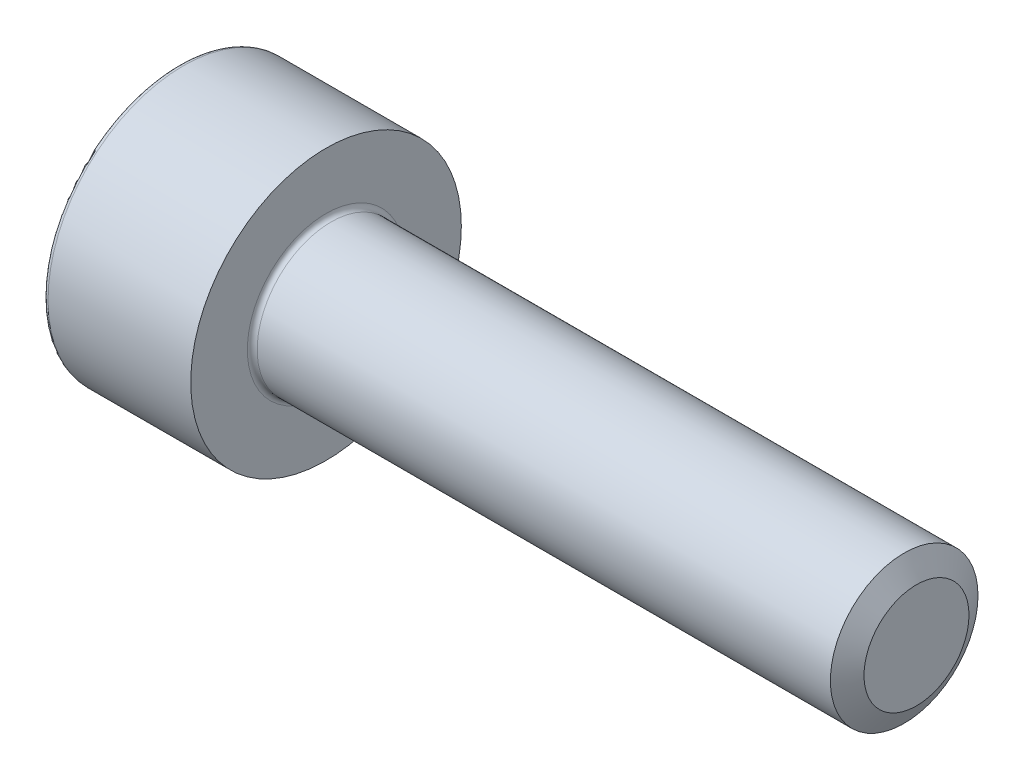
ISO-10303-21;
HEADER;
FILE_DESCRIPTION(('STEP AP214'),'2;1');
FILE_NAME('part.step','',(''),(''),'','','');
FILE_SCHEMA(('AUTOMOTIVE_DESIGN { 1 0 10303 214 1 1 1 1 }'));
ENDSEC;
DATA;
#1=APPLICATION_CONTEXT('core data for automotive mechanical design processes');
#2=APPLICATION_PROTOCOL_DEFINITION('international standard','automotive_design',2000,#1);
#3=PRODUCT_CONTEXT('',#1,'mechanical');
#4=PRODUCT('Part','Part','',(#3));
#5=PRODUCT_RELATED_PRODUCT_CATEGORY('part','',(#4));
#6=PRODUCT_DEFINITION_FORMATION('','',#4);
#7=PRODUCT_DEFINITION_CONTEXT('part definition',#1,'design');
#8=PRODUCT_DEFINITION('design','',#6,#7);
#9=PRODUCT_DEFINITION_SHAPE('','',#8);
#10=(LENGTH_UNIT() NAMED_UNIT(*) SI_UNIT(.MILLI.,.METRE.));
#11=(NAMED_UNIT(*) PLANE_ANGLE_UNIT() SI_UNIT($,.RADIAN.));
#12=(NAMED_UNIT(*) SI_UNIT($,.STERADIAN.) SOLID_ANGLE_UNIT());
#13=UNCERTAINTY_MEASURE_WITH_UNIT(LENGTH_MEASURE(1.E-05),#10,'distance_accuracy_value','');
#14=(GEOMETRIC_REPRESENTATION_CONTEXT(3) GLOBAL_UNCERTAINTY_ASSIGNED_CONTEXT((#13)) GLOBAL_UNIT_ASSIGNED_CONTEXT((#10,
#11,#12)) REPRESENTATION_CONTEXT('',''));
#15=CARTESIAN_POINT('',(0.,0.,0.));
#16=DIRECTION('',(0.,0.,1.));
#17=DIRECTION('',(1.,0.,0.));
#18=AXIS2_PLACEMENT_3D('',#15,#16,#17);
#19=CARTESIAN_POINT('',(0.,0.,0.));
#20=DIRECTION('',(1.,0.,0.));
#21=DIRECTION('',(0.,0.,-1.));
#22=AXIS2_PLACEMENT_3D('',#19,#20,#21);
#23=CYLINDRICAL_SURFACE('',#22,2.75);
#24=CARTESIAN_POINT('',(0.1,0.,0.));
#25=DIRECTION('',(-1.,0.,0.));
#26=DIRECTION('',(0.,0.,1.));
#27=AXIS2_PLACEMENT_3D('',#24,#25,#26);
#28=CIRCLE('',#27,2.75);
#29=CARTESIAN_POINT('',(0.1,0.,2.75));
#30=VERTEX_POINT('',#29);
#31=EDGE_CURVE('E44',#30,#30,#28,.F.);
#32=ORIENTED_EDGE('',*,*,#31,.T.);
#33=EDGE_LOOP('',(#32));
#34=FACE_BOUND('',#33,.T.);
#35=CARTESIAN_POINT('',(3.,0.,0.));
#36=DIRECTION('',(1.,0.,0.));
#37=DIRECTION('',(0.,0.,-1.));
#38=AXIS2_PLACEMENT_3D('',#35,#36,#37);
#39=CIRCLE('',#38,2.75);
#40=CARTESIAN_POINT('',(3.,0.,-2.75));
#41=VERTEX_POINT('',#40);
#42=EDGE_CURVE('E138',#41,#41,#39,.T.);
#43=ORIENTED_EDGE('',*,*,#42,.F.);
#44=EDGE_LOOP('',(#43));
#45=FACE_BOUND('',#44,.T.);
#46=ADVANCED_FACE('F36',(#34,#45),#23,.T.);
#47=CARTESIAN_POINT('',(0.,2.75,0.));
#48=DIRECTION('',(-1.,0.,0.));
#49=DIRECTION('',(0.,0.,1.));
#50=AXIS2_PLACEMENT_3D('',#47,#48,#49);
#51=PLANE('',#50);
#52=CARTESIAN_POINT('',(0.,0.,0.));
#53=DIRECTION('',(-1.,0.,0.));
#54=DIRECTION('',(0.,0.,1.));
#55=AXIS2_PLACEMENT_3D('',#52,#53,#54);
#56=CIRCLE('',#55,2.65);
#57=CARTESIAN_POINT('',(0.,0.,2.65));
#58=VERTEX_POINT('',#57);
#59=EDGE_CURVE('E11',#58,#58,#56,.T.);
#60=ORIENTED_EDGE('',*,*,#59,.T.);
#61=EDGE_LOOP('',(#60));
#62=FACE_BOUND('',#61,.T.);
#63=DIRECTION('',(0.,0.5,-0.866025403784439));
#64=VECTOR('',#63,1.);
#65=CARTESIAN_POINT('',(0.,0.7175,1.24274645443067));
#66=LINE('',#65,#64);
#67=CARTESIAN_POINT('',(0.,0.7175,1.24274645443067));
#68=VERTEX_POINT('',#67);
#69=CARTESIAN_POINT('',(0.,1.435,0.));
#70=VERTEX_POINT('',#69);
#71=EDGE_CURVE('E51',#68,#70,#66,.T.);
#72=ORIENTED_EDGE('',*,*,#71,.F.);
#73=DIRECTION('',(0.,1.,0.));
#74=VECTOR('',#73,1.);
#75=CARTESIAN_POINT('',(0.,-0.7175,1.24274645443067));
#76=LINE('',#75,#74);
#77=CARTESIAN_POINT('',(0.,-0.7175,1.24274645443067));
#78=VERTEX_POINT('',#77);
#79=EDGE_CURVE('E134',#78,#68,#76,.T.);
#80=ORIENTED_EDGE('',*,*,#79,.F.);
#81=DIRECTION('',(0.,0.5,0.866025403784439));
#82=VECTOR('',#81,1.);
#83=CARTESIAN_POINT('',(0.,-1.435,0.));
#84=LINE('',#83,#82);
#85=CARTESIAN_POINT('',(0.,-1.435,0.));
#86=VERTEX_POINT('',#85);
#87=EDGE_CURVE('E132',#86,#78,#84,.T.);
#88=ORIENTED_EDGE('',*,*,#87,.F.);
#89=DIRECTION('',(0.,-0.5,0.866025403784439));
#90=VECTOR('',#89,1.);
#91=CARTESIAN_POINT('',(0.,-0.7175,-1.24274645443067));
#92=LINE('',#91,#90);
#93=CARTESIAN_POINT('',(0.,-0.7175,-1.24274645443067));
#94=VERTEX_POINT('',#93);
#95=EDGE_CURVE('E99',#94,#86,#92,.T.);
#96=ORIENTED_EDGE('',*,*,#95,.F.);
#97=DIRECTION('',(0.,-1.,0.));
#98=VECTOR('',#97,1.);
#99=CARTESIAN_POINT('',(0.,0.7175,-1.24274645443067));
#100=LINE('',#99,#98);
#101=CARTESIAN_POINT('',(0.,0.7175,-1.24274645443067));
#102=VERTEX_POINT('',#101);
#103=EDGE_CURVE('E128',#102,#94,#100,.T.);
#104=ORIENTED_EDGE('',*,*,#103,.F.);
#105=DIRECTION('',(0.,-0.5,-0.866025403784439));
#106=VECTOR('',#105,1.);
#107=CARTESIAN_POINT('',(0.,1.435,0.));
#108=LINE('',#107,#106);
#109=EDGE_CURVE('E125',#70,#102,#108,.T.);
#110=ORIENTED_EDGE('',*,*,#109,.F.);
#111=EDGE_LOOP('',(#72,#80,#88,#96,#104,#110));
#112=FACE_BOUND('',#111,.T.);
#113=ADVANCED_FACE('F172',(#62,#112),#51,.T.);
#114=CARTESIAN_POINT('',(3.,0.,0.));
#115=DIRECTION('',(1.,0.,0.));
#116=DIRECTION('',(0.,0.,-1.));
#117=AXIS2_PLACEMENT_3D('',#114,#115,#116);
#118=PLANE('',#117);
#119=CARTESIAN_POINT('',(3.,0.,0.));
#120=DIRECTION('',(1.,0.,0.));
#121=DIRECTION('',(0.,0.,-1.));
#122=AXIS2_PLACEMENT_3D('',#119,#120,#121);
#123=CIRCLE('',#122,1.6);
#124=CARTESIAN_POINT('',(3.,0.,-1.6));
#125=VERTEX_POINT('',#124);
#126=EDGE_CURVE('E155',#125,#125,#123,.F.);
#127=ORIENTED_EDGE('',*,*,#126,.T.);
#128=EDGE_LOOP('',(#127));
#129=FACE_BOUND('',#128,.T.);
#130=ORIENTED_EDGE('',*,*,#42,.T.);
#131=EDGE_LOOP('',(#130));
#132=FACE_BOUND('',#131,.T.);
#133=ADVANCED_FACE('F177',(#129,#132),#118,.T.);
#134=CARTESIAN_POINT('',(15.,0.,0.));
#135=DIRECTION('',(-1.,0.,0.));
#136=DIRECTION('',(0.,0.,1.));
#137=AXIS2_PLACEMENT_3D('',#134,#135,#136);
#138=CYLINDRICAL_SURFACE('',#137,1.5);
#139=CARTESIAN_POINT('',(3.1,0.,0.));
#140=DIRECTION('',(1.,0.,0.));
#141=DIRECTION('',(0.,0.,-1.));
#142=AXIS2_PLACEMENT_3D('',#139,#140,#141);
#143=CIRCLE('',#142,1.5);
#144=CARTESIAN_POINT('',(3.1,0.,-1.5));
#145=VERTEX_POINT('',#144);
#146=EDGE_CURVE('E152',#145,#145,#143,.T.);
#147=ORIENTED_EDGE('',*,*,#146,.T.);
#148=EDGE_LOOP('',(#147));
#149=FACE_BOUND('',#148,.T.);
#150=CARTESIAN_POINT('',(14.7500000000067,0.,0.));
#151=DIRECTION('',(1.,0.,0.));
#152=DIRECTION('',(0.,0.,-1.));
#153=AXIS2_PLACEMENT_3D('',#150,#151,#152);
#154=CIRCLE('',#153,1.5);
#155=CARTESIAN_POINT('',(14.7500000000067,0.,-1.5));
#156=VERTEX_POINT('',#155);
#157=EDGE_CURVE('E149',#156,#156,#154,.F.);
#158=ORIENTED_EDGE('',*,*,#157,.T.);
#159=EDGE_LOOP('',(#158));
#160=FACE_BOUND('',#159,.T.);
#161=ADVANCED_FACE('F199',(#149,#160),#138,.T.);
#162=CARTESIAN_POINT('',(15.,0.,0.));
#163=DIRECTION('',(1.,0.,0.));
#164=DIRECTION('',(0.,0.,-1.));
#165=AXIS2_PLACEMENT_3D('',#162,#163,#164);
#166=PLANE('',#165);
#167=CARTESIAN_POINT('',(15.,0.,0.));
#168=DIRECTION('',(1.,0.,0.));
#169=DIRECTION('',(0.,0.,-1.));
#170=AXIS2_PLACEMENT_3D('',#167,#168,#169);
#171=CIRCLE('',#170,1.06700000002979);
#172=CARTESIAN_POINT('',(15.,0.,-1.06700000002979));
#173=VERTEX_POINT('',#172);
#174=EDGE_CURVE('E146',#173,#173,#171,.T.);
#175=ORIENTED_EDGE('',*,*,#174,.T.);
#176=EDGE_LOOP('',(#175));
#177=FACE_BOUND('',#176,.T.);
#178=ADVANCED_FACE('F196',(#177),#166,.T.);
#179=CARTESIAN_POINT('',(1.3,0.7175,1.24274645443067));
#180=DIRECTION('',(0.,0.866025403784439,0.5));
#181=DIRECTION('',(0.,-0.5,0.866025403784439));
#182=AXIS2_PLACEMENT_3D('',#179,#180,#181);
#183=PLANE('',#182);
#184=ORIENTED_EDGE('',*,*,#71,.T.);
#185=DIRECTION('',(-1.,0.,0.));
#186=VECTOR('',#185,1.);
#187=CARTESIAN_POINT('',(1.3,1.435,0.));
#188=LINE('',#187,#186);
#189=CARTESIAN_POINT('',(1.3,1.435,0.));
#190=VERTEX_POINT('',#189);
#191=EDGE_CURVE('E81',#190,#70,#188,.T.);
#192=ORIENTED_EDGE('',*,*,#191,.F.);
#193=DIRECTION('',(0.,0.5,-0.866025403784439));
#194=VECTOR('',#193,1.);
#195=CARTESIAN_POINT('',(1.3,0.7175,1.24274645443067));
#196=LINE('',#195,#194);
#197=CARTESIAN_POINT('',(1.3,0.7175,1.24274645443067));
#198=VERTEX_POINT('',#197);
#199=EDGE_CURVE('E136',#198,#190,#196,.T.);
#200=ORIENTED_EDGE('',*,*,#199,.F.);
#201=DIRECTION('',(-1.,0.,0.));
#202=VECTOR('',#201,1.);
#203=CARTESIAN_POINT('',(1.3,0.7175,1.24274645443067));
#204=LINE('',#203,#202);
#205=EDGE_CURVE('E59',#198,#68,#204,.T.);
#206=ORIENTED_EDGE('',*,*,#205,.T.);
#207=EDGE_LOOP('',(#184,#192,#200,#206));
#208=FACE_BOUND('',#207,.T.);
#209=ADVANCED_FACE('F198',(#208),#183,.F.);
#210=CARTESIAN_POINT('',(1.3,-0.7175,1.24274645443067));
#211=DIRECTION('',(0.,0.,1.));
#212=DIRECTION('',(1.,0.,0.));
#213=AXIS2_PLACEMENT_3D('',#210,#211,#212);
#214=PLANE('',#213);
#215=ORIENTED_EDGE('',*,*,#79,.T.);
#216=ORIENTED_EDGE('',*,*,#205,.F.);
#217=DIRECTION('',(0.,1.,0.));
#218=VECTOR('',#217,1.);
#219=CARTESIAN_POINT('',(1.3,-0.7175,1.24274645443067));
#220=LINE('',#219,#218);
#221=CARTESIAN_POINT('',(1.3,-0.7175,1.24274645443067));
#222=VERTEX_POINT('',#221);
#223=EDGE_CURVE('E111',#222,#198,#220,.T.);
#224=ORIENTED_EDGE('',*,*,#223,.F.);
#225=DIRECTION('',(-1.,0.,0.));
#226=VECTOR('',#225,1.);
#227=CARTESIAN_POINT('',(1.3,-0.7175,1.24274645443067));
#228=LINE('',#227,#226);
#229=EDGE_CURVE('E103',#222,#78,#228,.T.);
#230=ORIENTED_EDGE('',*,*,#229,.T.);
#231=EDGE_LOOP('',(#215,#216,#224,#230));
#232=FACE_BOUND('',#231,.T.);
#233=ADVANCED_FACE('F205',(#232),#214,.F.);
#234=CARTESIAN_POINT('',(1.3,-1.435,0.));
#235=DIRECTION('',(0.,-0.866025403784439,0.5));
#236=DIRECTION('',(0.,-0.5,-0.866025403784439));
#237=AXIS2_PLACEMENT_3D('',#234,#235,#236);
#238=PLANE('',#237);
#239=ORIENTED_EDGE('',*,*,#87,.T.);
#240=ORIENTED_EDGE('',*,*,#229,.F.);
#241=DIRECTION('',(0.,0.5,0.866025403784439));
#242=VECTOR('',#241,1.);
#243=CARTESIAN_POINT('',(1.3,-1.435,0.));
#244=LINE('',#243,#242);
#245=CARTESIAN_POINT('',(1.3,-1.435,0.));
#246=VERTEX_POINT('',#245);
#247=EDGE_CURVE('E107',#246,#222,#244,.T.);
#248=ORIENTED_EDGE('',*,*,#247,.F.);
#249=DIRECTION('',(-1.,0.,0.));
#250=VECTOR('',#249,1.);
#251=CARTESIAN_POINT('',(1.3,-1.435,0.));
#252=LINE('',#251,#250);
#253=EDGE_CURVE('E92',#246,#86,#252,.T.);
#254=ORIENTED_EDGE('',*,*,#253,.T.);
#255=EDGE_LOOP('',(#239,#240,#248,#254));
#256=FACE_BOUND('',#255,.T.);
#257=ADVANCED_FACE('F108',(#256),#238,.F.);
#258=CARTESIAN_POINT('',(1.3,-0.7175,-1.24274645443067));
#259=DIRECTION('',(0.,-0.866025403784439,-0.5));
#260=DIRECTION('',(0.,0.5,-0.866025403784439));
#261=AXIS2_PLACEMENT_3D('',#258,#259,#260);
#262=PLANE('',#261);
#263=ORIENTED_EDGE('',*,*,#95,.T.);
#264=ORIENTED_EDGE('',*,*,#253,.F.);
#265=DIRECTION('',(0.,-0.5,0.866025403784439));
#266=VECTOR('',#265,1.);
#267=CARTESIAN_POINT('',(1.3,-0.7175,-1.24274645443067));
#268=LINE('',#267,#266);
#269=CARTESIAN_POINT('',(1.3,-0.7175,-1.24274645443067));
#270=VERTEX_POINT('',#269);
#271=EDGE_CURVE('E96',#270,#246,#268,.T.);
#272=ORIENTED_EDGE('',*,*,#271,.F.);
#273=DIRECTION('',(-1.,0.,0.));
#274=VECTOR('',#273,1.);
#275=CARTESIAN_POINT('',(1.3,-0.7175,-1.24274645443067));
#276=LINE('',#275,#274);
#277=EDGE_CURVE('E104',#270,#94,#276,.T.);
#278=ORIENTED_EDGE('',*,*,#277,.T.);
#279=EDGE_LOOP('',(#263,#264,#272,#278));
#280=FACE_BOUND('',#279,.T.);
#281=ADVANCED_FACE('F94',(#280),#262,.F.);
#282=CARTESIAN_POINT('',(1.3,0.7175,-1.24274645443067));
#283=DIRECTION('',(0.,0.,-1.));
#284=DIRECTION('',(-1.,0.,0.));
#285=AXIS2_PLACEMENT_3D('',#282,#283,#284);
#286=PLANE('',#285);
#287=ORIENTED_EDGE('',*,*,#103,.T.);
#288=ORIENTED_EDGE('',*,*,#277,.F.);
#289=DIRECTION('',(0.,-1.,0.));
#290=VECTOR('',#289,1.);
#291=CARTESIAN_POINT('',(1.3,0.7175,-1.24274645443067));
#292=LINE('',#291,#290);
#293=CARTESIAN_POINT('',(1.3,0.7175,-1.24274645443067));
#294=VERTEX_POINT('',#293);
#295=EDGE_CURVE('E117',#294,#270,#292,.T.);
#296=ORIENTED_EDGE('',*,*,#295,.F.);
#297=DIRECTION('',(-1.,0.,0.));
#298=VECTOR('',#297,1.);
#299=CARTESIAN_POINT('',(1.3,0.7175,-1.24274645443067));
#300=LINE('',#299,#298);
#301=EDGE_CURVE('E141',#294,#102,#300,.T.);
#302=ORIENTED_EDGE('',*,*,#301,.T.);
#303=EDGE_LOOP('',(#287,#288,#296,#302));
#304=FACE_BOUND('',#303,.T.);
#305=ADVANCED_FACE('F256',(#304),#286,.F.);
#306=CARTESIAN_POINT('',(1.3,1.435,0.));
#307=DIRECTION('',(0.,0.866025403784439,-0.5));
#308=DIRECTION('',(0.,0.5,0.866025403784439));
#309=AXIS2_PLACEMENT_3D('',#306,#307,#308);
#310=PLANE('',#309);
#311=ORIENTED_EDGE('',*,*,#109,.T.);
#312=ORIENTED_EDGE('',*,*,#301,.F.);
#313=DIRECTION('',(0.,-0.5,-0.866025403784439));
#314=VECTOR('',#313,1.);
#315=CARTESIAN_POINT('',(1.3,1.435,0.));
#316=LINE('',#315,#314);
#317=EDGE_CURVE('E119',#190,#294,#316,.T.);
#318=ORIENTED_EDGE('',*,*,#317,.F.);
#319=ORIENTED_EDGE('',*,*,#191,.T.);
#320=EDGE_LOOP('',(#311,#312,#318,#319));
#321=FACE_BOUND('',#320,.T.);
#322=ADVANCED_FACE('F190',(#321),#310,.F.);
#323=CARTESIAN_POINT('',(1.3,0.,0.));
#324=DIRECTION('',(-1.,0.,0.));
#325=DIRECTION('',(0.,0.,1.));
#326=AXIS2_PLACEMENT_3D('',#323,#324,#325);
#327=PLANE('',#326);
#328=ORIENTED_EDGE('',*,*,#199,.T.);
#329=ORIENTED_EDGE('',*,*,#317,.T.);
#330=ORIENTED_EDGE('',*,*,#295,.T.);
#331=ORIENTED_EDGE('',*,*,#271,.T.);
#332=ORIENTED_EDGE('',*,*,#247,.T.);
#333=ORIENTED_EDGE('',*,*,#223,.T.);
#334=EDGE_LOOP('',(#328,#329,#330,#331,#332,#333));
#335=FACE_BOUND('',#334,.T.);
#336=ADVANCED_FACE('F114',(#335),#327,.T.);
#337=CARTESIAN_POINT('',(15.,0.,0.));
#338=DIRECTION('',(-1.,0.,0.));
#339=DIRECTION('',(0.,0.,1.));
#340=AXIS2_PLACEMENT_3D('',#337,#338,#339);
#341=CONICAL_SURFACE('',#340,1.06700000002979,1.04718484900674);
#342=ORIENTED_EDGE('',*,*,#157,.F.);
#343=EDGE_LOOP('',(#342));
#344=FACE_BOUND('',#343,.T.);
#345=ORIENTED_EDGE('',*,*,#174,.F.);
#346=EDGE_LOOP('',(#345));
#347=FACE_BOUND('',#346,.T.);
#348=ADVANCED_FACE('F168',(#344,#347),#341,.T.);
#349=CARTESIAN_POINT('',(3.1,0.,0.));
#350=DIRECTION('',(1.,0.,0.));
#351=DIRECTION('',(0.,0.,-1.));
#352=AXIS2_PLACEMENT_3D('',#349,#350,#351);
#353=TOROIDAL_SURFACE('',#352,1.6,0.1);
#354=ORIENTED_EDGE('',*,*,#126,.F.);
#355=EDGE_LOOP('',(#354));
#356=FACE_BOUND('',#355,.T.);
#357=ORIENTED_EDGE('',*,*,#146,.F.);
#358=EDGE_LOOP('',(#357));
#359=FACE_BOUND('',#358,.T.);
#360=ADVANCED_FACE('F163',(#356,#359),#353,.F.);
#361=CARTESIAN_POINT('',(0.1,0.,0.));
#362=DIRECTION('',(-1.,0.,0.));
#363=DIRECTION('',(0.,0.,1.));
#364=AXIS2_PLACEMENT_3D('',#361,#362,#363);
#365=TOROIDAL_SURFACE('',#364,2.65,0.1);
#366=ORIENTED_EDGE('',*,*,#59,.F.);
#367=EDGE_LOOP('',(#366));
#368=FACE_BOUND('',#367,.T.);
#369=ORIENTED_EDGE('',*,*,#31,.F.);
#370=EDGE_LOOP('',(#369));
#371=FACE_BOUND('',#370,.T.);
#372=ADVANCED_FACE('F38',(#368,#371),#365,.T.);
#373=CLOSED_SHELL('',(#46,#113,#133,#161,#178,#209,#233,#257,#281,#305,#322,#336,#348,#360,#372));
#374=MANIFOLD_SOLID_BREP('B2',#373);
#375=ADVANCED_BREP_SHAPE_REPRESENTATION('',(#18,#374),#14);
#376=SHAPE_DEFINITION_REPRESENTATION(#9,#375);
ENDSEC;
END-ISO-10303-21;
